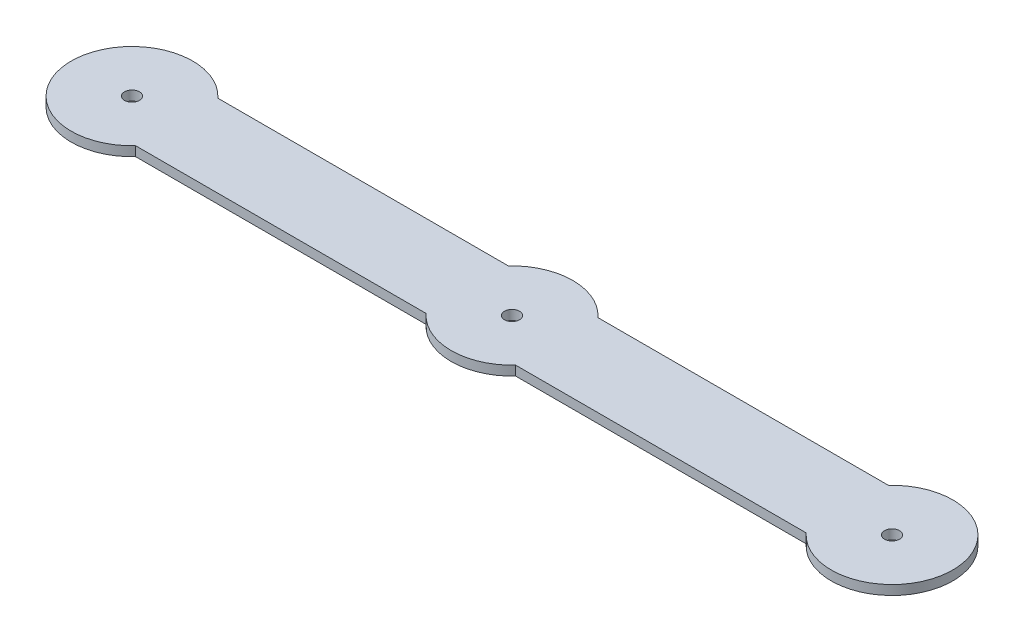
ISO-10303-21;
HEADER;
FILE_DESCRIPTION(('STEP AP214'),'2;1');
FILE_NAME('part.step','',(''),(''),'','','');
FILE_SCHEMA(('AUTOMOTIVE_DESIGN { 1 0 10303 214 1 1 1 1 }'));
ENDSEC;
DATA;
#1=APPLICATION_CONTEXT('core data for automotive mechanical design processes');
#2=APPLICATION_PROTOCOL_DEFINITION('international standard','automotive_design',2000,#1);
#3=PRODUCT_CONTEXT('',#1,'mechanical');
#4=PRODUCT('Part','Part','',(#3));
#5=PRODUCT_RELATED_PRODUCT_CATEGORY('part','',(#4));
#6=PRODUCT_DEFINITION_FORMATION('','',#4);
#7=PRODUCT_DEFINITION_CONTEXT('part definition',#1,'design');
#8=PRODUCT_DEFINITION('design','',#6,#7);
#9=PRODUCT_DEFINITION_SHAPE('','',#8);
#10=(LENGTH_UNIT() NAMED_UNIT(*) SI_UNIT(.MILLI.,.METRE.));
#11=(NAMED_UNIT(*) PLANE_ANGLE_UNIT() SI_UNIT($,.RADIAN.));
#12=(NAMED_UNIT(*) SI_UNIT($,.STERADIAN.) SOLID_ANGLE_UNIT());
#13=UNCERTAINTY_MEASURE_WITH_UNIT(LENGTH_MEASURE(1.E-05),#10,'distance_accuracy_value','');
#14=(GEOMETRIC_REPRESENTATION_CONTEXT(3) GLOBAL_UNCERTAINTY_ASSIGNED_CONTEXT((#13)) GLOBAL_UNIT_ASSIGNED_CONTEXT((#10,
#11,#12)) REPRESENTATION_CONTEXT('',''));
#15=CARTESIAN_POINT('',(0.,0.,0.));
#16=DIRECTION('',(0.,0.,1.));
#17=DIRECTION('',(1.,0.,0.));
#18=AXIS2_PLACEMENT_3D('',#15,#16,#17);
#19=CARTESIAN_POINT('',(0.,2.54,0.));
#20=DIRECTION('',(0.,-1.,0.));
#21=DIRECTION('',(0.,0.,-1.));
#22=AXIS2_PLACEMENT_3D('',#19,#20,#21);
#23=CYLINDRICAL_SURFACE('',#22,16.252288298);
#24=CARTESIAN_POINT('',(0.,0.,0.));
#25=DIRECTION('',(0.,1.,0.));
#26=DIRECTION('',(0.,0.,1.));
#27=AXIS2_PLACEMENT_3D('',#24,#25,#26);
#28=CIRCLE('',#27,16.252288298);
#29=CARTESIAN_POINT('',(11.9639824022483,0.,-11.));
#30=VERTEX_POINT('',#29);
#31=CARTESIAN_POINT('',(-11.9639824022483,0.,-11.));
#32=VERTEX_POINT('',#31);
#33=EDGE_CURVE('E129',#30,#32,#28,.T.);
#34=ORIENTED_EDGE('',*,*,#33,.T.);
#35=DIRECTION('',(0.,-1.,0.));
#36=VECTOR('',#35,1.);
#37=CARTESIAN_POINT('',(-11.9639824022483,2.54,-11.));
#38=LINE('',#37,#36);
#39=CARTESIAN_POINT('',(-11.9639824022483,2.54,-11.));
#40=VERTEX_POINT('',#39);
#41=EDGE_CURVE('E11',#40,#32,#38,.T.);
#42=ORIENTED_EDGE('',*,*,#41,.F.);
#43=CARTESIAN_POINT('',(0.,2.54,0.));
#44=DIRECTION('',(0.,1.,0.));
#45=DIRECTION('',(0.,0.,1.));
#46=AXIS2_PLACEMENT_3D('',#43,#44,#45);
#47=CIRCLE('',#46,16.252288298);
#48=CARTESIAN_POINT('',(11.9639824022483,2.54,-11.));
#49=VERTEX_POINT('',#48);
#50=EDGE_CURVE('E144',#49,#40,#47,.T.);
#51=ORIENTED_EDGE('',*,*,#50,.F.);
#52=DIRECTION('',(0.,-1.,0.));
#53=VECTOR('',#52,1.);
#54=CARTESIAN_POINT('',(11.9639824022483,2.54,-11.));
#55=LINE('',#54,#53);
#56=EDGE_CURVE('E125',#49,#30,#55,.T.);
#57=ORIENTED_EDGE('',*,*,#56,.T.);
#58=EDGE_LOOP('',(#34,#42,#51,#57));
#59=FACE_BOUND('',#58,.T.);
#60=ADVANCED_FACE('F33',(#59),#23,.T.);
#61=CARTESIAN_POINT('',(-89.6360175977516,2.54,-11.));
#62=DIRECTION('',(0.,0.,1.));
#63=DIRECTION('',(1.,0.,0.));
#64=AXIS2_PLACEMENT_3D('',#61,#62,#63);
#65=PLANE('',#64);
#66=DIRECTION('',(-1.,0.,0.));
#67=VECTOR('',#66,1.);
#68=CARTESIAN_POINT('',(-89.6360175977516,0.,-11.));
#69=LINE('',#68,#67);
#70=CARTESIAN_POINT('',(-89.6360175977516,0.,-11.));
#71=VERTEX_POINT('',#70);
#72=EDGE_CURVE('E132',#32,#71,#69,.T.);
#73=ORIENTED_EDGE('',*,*,#72,.T.);
#74=DIRECTION('',(0.,-1.,0.));
#75=VECTOR('',#74,1.);
#76=CARTESIAN_POINT('',(-89.6360175977516,2.54,-11.));
#77=LINE('',#76,#75);
#78=CARTESIAN_POINT('',(-89.6360175977516,2.54,-11.));
#79=VERTEX_POINT('',#78);
#80=EDGE_CURVE('E41',#79,#71,#77,.T.);
#81=ORIENTED_EDGE('',*,*,#80,.F.);
#82=DIRECTION('',(-1.,0.,0.));
#83=VECTOR('',#82,1.);
#84=CARTESIAN_POINT('',(-89.6360175977516,2.54,-11.));
#85=LINE('',#84,#83);
#86=EDGE_CURVE('E92',#40,#79,#85,.T.);
#87=ORIENTED_EDGE('',*,*,#86,.F.);
#88=ORIENTED_EDGE('',*,*,#41,.T.);
#89=EDGE_LOOP('',(#73,#81,#87,#88));
#90=FACE_BOUND('',#89,.T.);
#91=ADVANCED_FACE('F209',(#90),#65,.F.);
#92=CARTESIAN_POINT('',(-101.6,2.54,0.));
#93=DIRECTION('',(0.,-1.,0.));
#94=DIRECTION('',(0.,0.,-1.));
#95=AXIS2_PLACEMENT_3D('',#92,#93,#94);
#96=CYLINDRICAL_SURFACE('',#95,16.252288298);
#97=CARTESIAN_POINT('',(-101.6,0.,0.));
#98=DIRECTION('',(0.,1.,0.));
#99=DIRECTION('',(0.,0.,1.));
#100=AXIS2_PLACEMENT_3D('',#97,#98,#99);
#101=CIRCLE('',#100,16.252288298);
#102=CARTESIAN_POINT('',(-89.6360175977516,0.,11.));
#103=VERTEX_POINT('',#102);
#104=EDGE_CURVE('E135',#71,#103,#101,.T.);
#105=ORIENTED_EDGE('',*,*,#104,.T.);
#106=DIRECTION('',(0.,-1.,0.));
#107=VECTOR('',#106,1.);
#108=CARTESIAN_POINT('',(-89.6360175977516,2.54,11.));
#109=LINE('',#108,#107);
#110=CARTESIAN_POINT('',(-89.6360175977516,2.54,11.));
#111=VERTEX_POINT('',#110);
#112=EDGE_CURVE('E151',#111,#103,#109,.T.);
#113=ORIENTED_EDGE('',*,*,#112,.F.);
#114=CARTESIAN_POINT('',(-101.6,2.54,0.));
#115=DIRECTION('',(0.,1.,0.));
#116=DIRECTION('',(0.,0.,1.));
#117=AXIS2_PLACEMENT_3D('',#114,#115,#116);
#118=CIRCLE('',#117,16.252288298);
#119=EDGE_CURVE('E159',#79,#111,#118,.T.);
#120=ORIENTED_EDGE('',*,*,#119,.F.);
#121=ORIENTED_EDGE('',*,*,#80,.T.);
#122=EDGE_LOOP('',(#105,#113,#120,#121));
#123=FACE_BOUND('',#122,.T.);
#124=ADVANCED_FACE('F157',(#123),#96,.T.);
#125=CARTESIAN_POINT('',(-89.6360175977516,2.54,11.));
#126=DIRECTION('',(0.,0.,-1.));
#127=DIRECTION('',(-1.,0.,0.));
#128=AXIS2_PLACEMENT_3D('',#125,#126,#127);
#129=PLANE('',#128);
#130=DIRECTION('',(1.,0.,0.));
#131=VECTOR('',#130,1.);
#132=CARTESIAN_POINT('',(-89.6360175977516,0.,11.));
#133=LINE('',#132,#131);
#134=CARTESIAN_POINT('',(-11.9639824022483,0.,11.));
#135=VERTEX_POINT('',#134);
#136=EDGE_CURVE('E137',#103,#135,#133,.T.);
#137=ORIENTED_EDGE('',*,*,#136,.T.);
#138=DIRECTION('',(0.,-1.,0.));
#139=VECTOR('',#138,1.);
#140=CARTESIAN_POINT('',(-11.9639824022483,2.54,11.));
#141=LINE('',#140,#139);
#142=CARTESIAN_POINT('',(-11.9639824022483,2.54,11.));
#143=VERTEX_POINT('',#142);
#144=EDGE_CURVE('E148',#143,#135,#141,.T.);
#145=ORIENTED_EDGE('',*,*,#144,.F.);
#146=DIRECTION('',(1.,0.,0.));
#147=VECTOR('',#146,1.);
#148=CARTESIAN_POINT('',(-89.6360175977516,2.54,11.));
#149=LINE('',#148,#147);
#150=EDGE_CURVE('E171',#111,#143,#149,.T.);
#151=ORIENTED_EDGE('',*,*,#150,.F.);
#152=ORIENTED_EDGE('',*,*,#112,.T.);
#153=EDGE_LOOP('',(#137,#145,#151,#152));
#154=FACE_BOUND('',#153,.T.);
#155=ADVANCED_FACE('F167',(#154),#129,.F.);
#156=CARTESIAN_POINT('',(0.,2.54,0.));
#157=DIRECTION('',(0.,-1.,0.));
#158=DIRECTION('',(0.,0.,-1.));
#159=AXIS2_PLACEMENT_3D('',#156,#157,#158);
#160=CYLINDRICAL_SURFACE('',#159,16.252288298);
#161=CARTESIAN_POINT('',(0.,0.,0.));
#162=DIRECTION('',(0.,1.,0.));
#163=DIRECTION('',(0.,0.,1.));
#164=AXIS2_PLACEMENT_3D('',#161,#162,#163);
#165=CIRCLE('',#164,16.252288298);
#166=CARTESIAN_POINT('',(11.9639824022483,0.,11.));
#167=VERTEX_POINT('',#166);
#168=EDGE_CURVE('E139',#135,#167,#165,.T.);
#169=ORIENTED_EDGE('',*,*,#168,.T.);
#170=DIRECTION('',(0.,-1.,0.));
#171=VECTOR('',#170,1.);
#172=CARTESIAN_POINT('',(11.9639824022483,2.54,11.));
#173=LINE('',#172,#171);
#174=CARTESIAN_POINT('',(11.9639824022483,2.54,11.));
#175=VERTEX_POINT('',#174);
#176=EDGE_CURVE('E120',#175,#167,#173,.T.);
#177=ORIENTED_EDGE('',*,*,#176,.F.);
#178=CARTESIAN_POINT('',(0.,2.54,0.));
#179=DIRECTION('',(0.,1.,0.));
#180=DIRECTION('',(0.,0.,1.));
#181=AXIS2_PLACEMENT_3D('',#178,#179,#180);
#182=CIRCLE('',#181,16.252288298);
#183=EDGE_CURVE('E111',#143,#175,#182,.T.);
#184=ORIENTED_EDGE('',*,*,#183,.F.);
#185=ORIENTED_EDGE('',*,*,#144,.T.);
#186=EDGE_LOOP('',(#169,#177,#184,#185));
#187=FACE_BOUND('',#186,.T.);
#188=ADVANCED_FACE('F170',(#187),#160,.T.);
#189=CARTESIAN_POINT('',(11.9639824022483,2.54,11.));
#190=DIRECTION('',(0.,0.,-1.));
#191=DIRECTION('',(-1.,0.,0.));
#192=AXIS2_PLACEMENT_3D('',#189,#190,#191);
#193=PLANE('',#192);
#194=DIRECTION('',(1.,0.,0.));
#195=VECTOR('',#194,1.);
#196=CARTESIAN_POINT('',(11.9639824022483,0.,11.));
#197=LINE('',#196,#195);
#198=CARTESIAN_POINT('',(89.6360175977516,0.,11.));
#199=VERTEX_POINT('',#198);
#200=EDGE_CURVE('E119',#167,#199,#197,.T.);
#201=ORIENTED_EDGE('',*,*,#200,.T.);
#202=DIRECTION('',(0.,-1.,0.));
#203=VECTOR('',#202,1.);
#204=CARTESIAN_POINT('',(89.6360175977516,2.54,11.));
#205=LINE('',#204,#203);
#206=CARTESIAN_POINT('',(89.6360175977516,2.54,11.));
#207=VERTEX_POINT('',#206);
#208=EDGE_CURVE('E116',#207,#199,#205,.T.);
#209=ORIENTED_EDGE('',*,*,#208,.F.);
#210=DIRECTION('',(1.,0.,0.));
#211=VECTOR('',#210,1.);
#212=CARTESIAN_POINT('',(11.9639824022483,2.54,11.));
#213=LINE('',#212,#211);
#214=EDGE_CURVE('E105',#175,#207,#213,.T.);
#215=ORIENTED_EDGE('',*,*,#214,.F.);
#216=ORIENTED_EDGE('',*,*,#176,.T.);
#217=EDGE_LOOP('',(#201,#209,#215,#216));
#218=FACE_BOUND('',#217,.T.);
#219=ADVANCED_FACE('F117',(#218),#193,.F.);
#220=CARTESIAN_POINT('',(101.6,2.54,0.));
#221=DIRECTION('',(0.,-1.,0.));
#222=DIRECTION('',(0.,0.,-1.));
#223=AXIS2_PLACEMENT_3D('',#220,#221,#222);
#224=CYLINDRICAL_SURFACE('',#223,16.252288298);
#225=CARTESIAN_POINT('',(101.6,0.,0.));
#226=DIRECTION('',(0.,1.,0.));
#227=DIRECTION('',(0.,0.,1.));
#228=AXIS2_PLACEMENT_3D('',#225,#226,#227);
#229=CIRCLE('',#228,16.252288298);
#230=CARTESIAN_POINT('',(89.6360175977516,0.,-11.));
#231=VERTEX_POINT('',#230);
#232=EDGE_CURVE('E78',#199,#231,#229,.T.);
#233=ORIENTED_EDGE('',*,*,#232,.T.);
#234=DIRECTION('',(0.,-1.,0.));
#235=VECTOR('',#234,1.);
#236=CARTESIAN_POINT('',(89.6360175977516,2.54,-11.));
#237=LINE('',#236,#235);
#238=CARTESIAN_POINT('',(89.6360175977516,2.54,-11.));
#239=VERTEX_POINT('',#238);
#240=EDGE_CURVE('E121',#239,#231,#237,.T.);
#241=ORIENTED_EDGE('',*,*,#240,.F.);
#242=CARTESIAN_POINT('',(101.6,2.54,0.));
#243=DIRECTION('',(0.,1.,0.));
#244=DIRECTION('',(0.,0.,1.));
#245=AXIS2_PLACEMENT_3D('',#242,#243,#244);
#246=CIRCLE('',#245,16.252288298);
#247=EDGE_CURVE('E109',#207,#239,#246,.T.);
#248=ORIENTED_EDGE('',*,*,#247,.F.);
#249=ORIENTED_EDGE('',*,*,#208,.T.);
#250=EDGE_LOOP('',(#233,#241,#248,#249));
#251=FACE_BOUND('',#250,.T.);
#252=ADVANCED_FACE('F123',(#251),#224,.T.);
#253=CARTESIAN_POINT('',(11.9639824022483,2.54,-11.));
#254=DIRECTION('',(0.,0.,1.));
#255=DIRECTION('',(1.,0.,0.));
#256=AXIS2_PLACEMENT_3D('',#253,#254,#255);
#257=PLANE('',#256);
#258=DIRECTION('',(-1.,0.,0.));
#259=VECTOR('',#258,1.);
#260=CARTESIAN_POINT('',(11.9639824022483,0.,-11.));
#261=LINE('',#260,#259);
#262=EDGE_CURVE('E84',#231,#30,#261,.T.);
#263=ORIENTED_EDGE('',*,*,#262,.T.);
#264=ORIENTED_EDGE('',*,*,#56,.F.);
#265=DIRECTION('',(-1.,0.,0.));
#266=VECTOR('',#265,1.);
#267=CARTESIAN_POINT('',(11.9639824022483,2.54,-11.));
#268=LINE('',#267,#266);
#269=EDGE_CURVE('E49',#239,#49,#268,.T.);
#270=ORIENTED_EDGE('',*,*,#269,.F.);
#271=ORIENTED_EDGE('',*,*,#240,.T.);
#272=EDGE_LOOP('',(#263,#264,#270,#271));
#273=FACE_BOUND('',#272,.T.);
#274=ADVANCED_FACE('F216',(#273),#257,.F.);
#275=CARTESIAN_POINT('',(0.,2.54,0.));
#276=DIRECTION('',(0.,1.,0.));
#277=DIRECTION('',(0.,0.,1.));
#278=AXIS2_PLACEMENT_3D('',#275,#276,#277);
#279=PLANE('',#278);
#280=CARTESIAN_POINT('',(-101.6,2.54,0.));
#281=DIRECTION('',(0.,1.,0.));
#282=DIRECTION('',(0.,0.,1.));
#283=AXIS2_PLACEMENT_3D('',#280,#281,#282);
#284=CIRCLE('',#283,2.);
#285=CARTESIAN_POINT('',(-101.6,2.54,2.));
#286=VERTEX_POINT('',#285);
#287=EDGE_CURVE('E133',#286,#286,#284,.T.);
#288=ORIENTED_EDGE('',*,*,#287,.F.);
#289=EDGE_LOOP('',(#288));
#290=FACE_BOUND('',#289,.T.);
#291=CARTESIAN_POINT('',(101.6,2.54,0.));
#292=DIRECTION('',(0.,1.,0.));
#293=DIRECTION('',(0.,0.,1.));
#294=AXIS2_PLACEMENT_3D('',#291,#292,#293);
#295=CIRCLE('',#294,2.);
#296=CARTESIAN_POINT('',(101.6,2.54,2.));
#297=VERTEX_POINT('',#296);
#298=EDGE_CURVE('E179',#297,#297,#295,.T.);
#299=ORIENTED_EDGE('',*,*,#298,.F.);
#300=EDGE_LOOP('',(#299));
#301=FACE_BOUND('',#300,.T.);
#302=CARTESIAN_POINT('',(0.,2.54,0.));
#303=DIRECTION('',(0.,1.,0.));
#304=DIRECTION('',(0.,0.,1.));
#305=AXIS2_PLACEMENT_3D('',#302,#303,#304);
#306=CIRCLE('',#305,2.);
#307=CARTESIAN_POINT('',(0.,2.54,2.));
#308=VERTEX_POINT('',#307);
#309=EDGE_CURVE('E182',#308,#308,#306,.T.);
#310=ORIENTED_EDGE('',*,*,#309,.F.);
#311=EDGE_LOOP('',(#310));
#312=FACE_BOUND('',#311,.T.);
#313=ORIENTED_EDGE('',*,*,#50,.T.);
#314=ORIENTED_EDGE('',*,*,#86,.T.);
#315=ORIENTED_EDGE('',*,*,#119,.T.);
#316=ORIENTED_EDGE('',*,*,#150,.T.);
#317=ORIENTED_EDGE('',*,*,#183,.T.);
#318=ORIENTED_EDGE('',*,*,#214,.T.);
#319=ORIENTED_EDGE('',*,*,#247,.T.);
#320=ORIENTED_EDGE('',*,*,#269,.T.);
#321=EDGE_LOOP('',(#313,#314,#315,#316,#317,#318,#319,#320));
#322=FACE_BOUND('',#321,.T.);
#323=ADVANCED_FACE('F107',(#290,#301,#312,#322),#279,.T.);
#324=CARTESIAN_POINT('',(0.,0.,0.));
#325=DIRECTION('',(0.,1.,0.));
#326=DIRECTION('',(0.,0.,1.));
#327=AXIS2_PLACEMENT_3D('',#324,#325,#326);
#328=PLANE('',#327);
#329=CARTESIAN_POINT('',(-101.6,0.,0.));
#330=DIRECTION('',(0.,1.,0.));
#331=DIRECTION('',(0.,0.,1.));
#332=AXIS2_PLACEMENT_3D('',#329,#330,#331);
#333=CIRCLE('',#332,2.);
#334=CARTESIAN_POINT('',(-101.6,0.,2.));
#335=VERTEX_POINT('',#334);
#336=EDGE_CURVE('E185',#335,#335,#333,.T.);
#337=ORIENTED_EDGE('',*,*,#336,.T.);
#338=EDGE_LOOP('',(#337));
#339=FACE_BOUND('',#338,.T.);
#340=CARTESIAN_POINT('',(101.6,0.,0.));
#341=DIRECTION('',(0.,1.,0.));
#342=DIRECTION('',(0.,0.,1.));
#343=AXIS2_PLACEMENT_3D('',#340,#341,#342);
#344=CIRCLE('',#343,2.);
#345=CARTESIAN_POINT('',(101.6,0.,2.));
#346=VERTEX_POINT('',#345);
#347=EDGE_CURVE('E189',#346,#346,#344,.T.);
#348=ORIENTED_EDGE('',*,*,#347,.T.);
#349=EDGE_LOOP('',(#348));
#350=FACE_BOUND('',#349,.T.);
#351=CARTESIAN_POINT('',(0.,0.,0.));
#352=DIRECTION('',(0.,1.,0.));
#353=DIRECTION('',(0.,0.,1.));
#354=AXIS2_PLACEMENT_3D('',#351,#352,#353);
#355=CIRCLE('',#354,2.);
#356=CARTESIAN_POINT('',(0.,0.,2.));
#357=VERTEX_POINT('',#356);
#358=EDGE_CURVE('E186',#357,#357,#355,.T.);
#359=ORIENTED_EDGE('',*,*,#358,.T.);
#360=EDGE_LOOP('',(#359));
#361=FACE_BOUND('',#360,.T.);
#362=ORIENTED_EDGE('',*,*,#33,.F.);
#363=ORIENTED_EDGE('',*,*,#262,.F.);
#364=ORIENTED_EDGE('',*,*,#232,.F.);
#365=ORIENTED_EDGE('',*,*,#200,.F.);
#366=ORIENTED_EDGE('',*,*,#168,.F.);
#367=ORIENTED_EDGE('',*,*,#136,.F.);
#368=ORIENTED_EDGE('',*,*,#104,.F.);
#369=ORIENTED_EDGE('',*,*,#72,.F.);
#370=EDGE_LOOP('',(#362,#363,#364,#365,#366,#367,#368,#369));
#371=FACE_BOUND('',#370,.T.);
#372=ADVANCED_FACE('F163',(#339,#350,#361,#371),#328,.F.);
#373=CARTESIAN_POINT('',(0.,0.,0.));
#374=DIRECTION('',(0.,1.,0.));
#375=DIRECTION('',(0.,0.,1.));
#376=AXIS2_PLACEMENT_3D('',#373,#374,#375);
#377=CYLINDRICAL_SURFACE('',#376,2.);
#378=ORIENTED_EDGE('',*,*,#309,.T.);
#379=EDGE_LOOP('',(#378));
#380=FACE_BOUND('',#379,.T.);
#381=ORIENTED_EDGE('',*,*,#358,.F.);
#382=EDGE_LOOP('',(#381));
#383=FACE_BOUND('',#382,.T.);
#384=ADVANCED_FACE('F205',(#380,#383),#377,.F.);
#385=CARTESIAN_POINT('',(101.6,0.,0.));
#386=DIRECTION('',(0.,1.,0.));
#387=DIRECTION('',(0.,0.,1.));
#388=AXIS2_PLACEMENT_3D('',#385,#386,#387);
#389=CYLINDRICAL_SURFACE('',#388,2.);
#390=ORIENTED_EDGE('',*,*,#298,.T.);
#391=EDGE_LOOP('',(#390));
#392=FACE_BOUND('',#391,.T.);
#393=ORIENTED_EDGE('',*,*,#347,.F.);
#394=EDGE_LOOP('',(#393));
#395=FACE_BOUND('',#394,.T.);
#396=ADVANCED_FACE('F199',(#392,#395),#389,.F.);
#397=CARTESIAN_POINT('',(-101.6,0.,0.));
#398=DIRECTION('',(0.,1.,0.));
#399=DIRECTION('',(0.,0.,1.));
#400=AXIS2_PLACEMENT_3D('',#397,#398,#399);
#401=CYLINDRICAL_SURFACE('',#400,2.);
#402=ORIENTED_EDGE('',*,*,#287,.T.);
#403=EDGE_LOOP('',(#402));
#404=FACE_BOUND('',#403,.T.);
#405=ORIENTED_EDGE('',*,*,#336,.F.);
#406=EDGE_LOOP('',(#405));
#407=FACE_BOUND('',#406,.T.);
#408=ADVANCED_FACE('F197',(#404,#407),#401,.F.);
#409=CLOSED_SHELL('',(#60,#91,#124,#155,#188,#219,#252,#274,#323,#372,#384,#396,#408));
#410=MANIFOLD_SOLID_BREP('B2',#409);
#411=ADVANCED_BREP_SHAPE_REPRESENTATION('',(#18,#410),#14);
#412=SHAPE_DEFINITION_REPRESENTATION(#9,#411);
ENDSEC;
END-ISO-10303-21;
